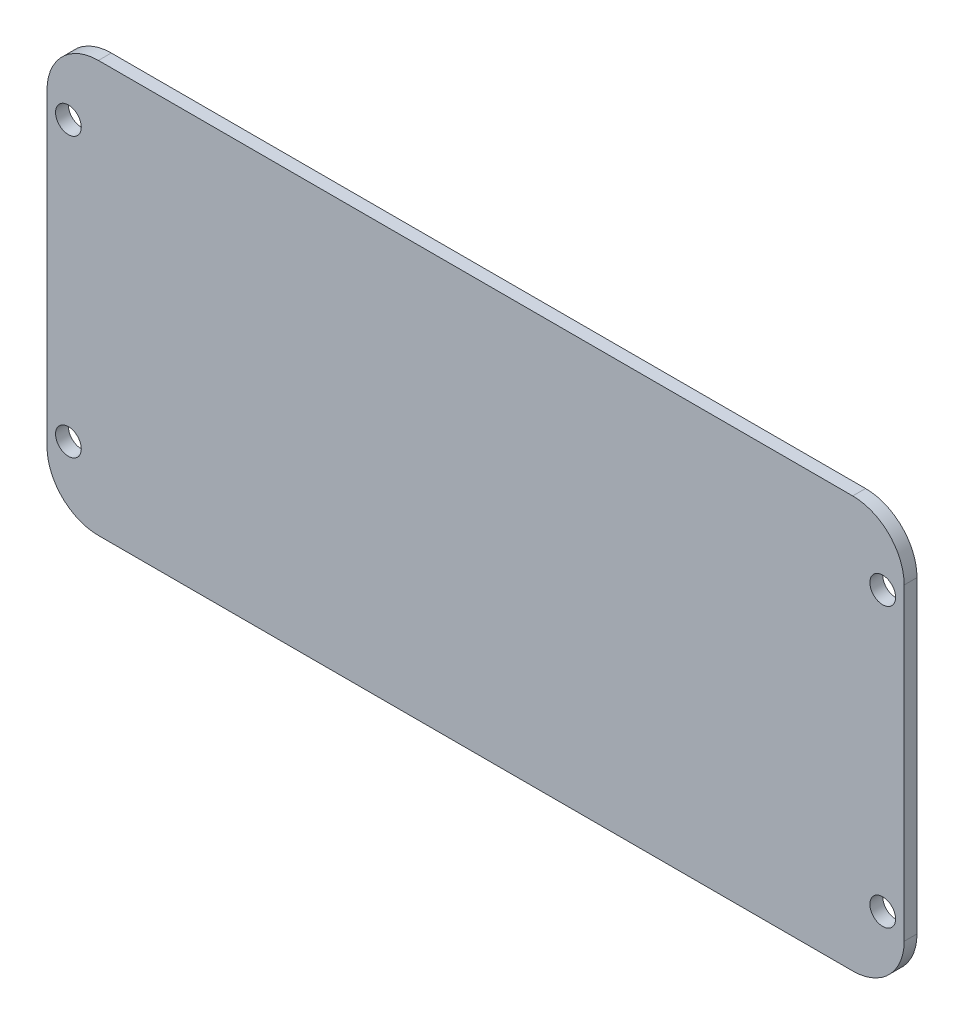
ISO-10303-21;
HEADER;
FILE_DESCRIPTION(('STEP AP214'),'2;1');
FILE_NAME('part.step','',(''),(''),'','','');
FILE_SCHEMA(('AUTOMOTIVE_DESIGN { 1 0 10303 214 1 1 1 1 }'));
ENDSEC;
DATA;
#1=APPLICATION_CONTEXT('core data for automotive mechanical design processes');
#2=APPLICATION_PROTOCOL_DEFINITION('international standard','automotive_design',2000,#1);
#3=PRODUCT_CONTEXT('',#1,'mechanical');
#4=PRODUCT('Part','Part','',(#3));
#5=PRODUCT_RELATED_PRODUCT_CATEGORY('part','',(#4));
#6=PRODUCT_DEFINITION_FORMATION('','',#4);
#7=PRODUCT_DEFINITION_CONTEXT('part definition',#1,'design');
#8=PRODUCT_DEFINITION('design','',#6,#7);
#9=PRODUCT_DEFINITION_SHAPE('','',#8);
#10=(LENGTH_UNIT() NAMED_UNIT(*) SI_UNIT(.MILLI.,.METRE.));
#11=(NAMED_UNIT(*) PLANE_ANGLE_UNIT() SI_UNIT($,.RADIAN.));
#12=(NAMED_UNIT(*) SI_UNIT($,.STERADIAN.) SOLID_ANGLE_UNIT());
#13=UNCERTAINTY_MEASURE_WITH_UNIT(LENGTH_MEASURE(1.E-05),#10,'distance_accuracy_value','');
#14=(GEOMETRIC_REPRESENTATION_CONTEXT(3) GLOBAL_UNCERTAINTY_ASSIGNED_CONTEXT((#13)) GLOBAL_UNIT_ASSIGNED_CONTEXT((#10,
#11,#12)) REPRESENTATION_CONTEXT('',''));
#15=CARTESIAN_POINT('',(0.,0.,0.));
#16=DIRECTION('',(0.,0.,1.));
#17=DIRECTION('',(1.,0.,0.));
#18=AXIS2_PLACEMENT_3D('',#15,#16,#17);
#19=CARTESIAN_POINT('',(49.4107481559537,14.8,1.5));
#20=DIRECTION('',(0.,0.,1.));
#21=DIRECTION('',(1.,0.,0.));
#22=AXIS2_PLACEMENT_3D('',#19,#20,#21);
#23=PLANE('',#22);
#24=CARTESIAN_POINT('',(52.9107481559537,-19.45,1.5));
#25=DIRECTION('',(0.,0.,1.));
#26=DIRECTION('',(1.,0.,0.));
#27=AXIS2_PLACEMENT_3D('',#24,#25,#26);
#28=CIRCLE('',#27,1.5);
#29=CARTESIAN_POINT('',(54.4107481559537,-19.45,1.5));
#30=VERTEX_POINT('',#29);
#31=EDGE_CURVE('E187',#30,#30,#28,.T.);
#32=ORIENTED_EDGE('',*,*,#31,.F.);
#33=EDGE_LOOP('',(#32));
#34=FACE_BOUND('',#33,.T.);
#35=CARTESIAN_POINT('',(-42.0892518440463,13.05,1.5));
#36=DIRECTION('',(0.,0.,1.));
#37=DIRECTION('',(1.,0.,0.));
#38=AXIS2_PLACEMENT_3D('',#35,#36,#37);
#39=CIRCLE('',#38,1.5);
#40=CARTESIAN_POINT('',(-40.5892518440463,13.05,1.5));
#41=VERTEX_POINT('',#40);
#42=EDGE_CURVE('E133',#41,#41,#39,.T.);
#43=ORIENTED_EDGE('',*,*,#42,.F.);
#44=EDGE_LOOP('',(#43));
#45=FACE_BOUND('',#44,.T.);
#46=CARTESIAN_POINT('',(49.4107481559537,14.8,1.5));
#47=DIRECTION('',(0.,0.,1.));
#48=DIRECTION('',(1.,0.,0.));
#49=AXIS2_PLACEMENT_3D('',#46,#47,#48);
#50=CIRCLE('',#49,6.);
#51=CARTESIAN_POINT('',(55.4107481559537,14.8,1.5));
#52=VERTEX_POINT('',#51);
#53=CARTESIAN_POINT('',(49.4107481559536,20.8,1.5));
#54=VERTEX_POINT('',#53);
#55=EDGE_CURVE('E144',#52,#54,#50,.T.);
#56=ORIENTED_EDGE('',*,*,#55,.T.);
#57=DIRECTION('',(-1.,0.,0.));
#58=VECTOR('',#57,1.);
#59=CARTESIAN_POINT('',(-38.5892518440463,20.8,1.5));
#60=LINE('',#59,#58);
#61=CARTESIAN_POINT('',(-38.5892518440463,20.8,1.5));
#62=VERTEX_POINT('',#61);
#63=EDGE_CURVE('E92',#54,#62,#60,.T.);
#64=ORIENTED_EDGE('',*,*,#63,.T.);
#65=CARTESIAN_POINT('',(-38.5892518440463,14.8,1.5));
#66=DIRECTION('',(0.,0.,1.));
#67=DIRECTION('',(-1.,0.,0.));
#68=AXIS2_PLACEMENT_3D('',#65,#66,#67);
#69=CIRCLE('',#68,6.);
#70=CARTESIAN_POINT('',(-44.5892518440463,14.8,1.5));
#71=VERTEX_POINT('',#70);
#72=EDGE_CURVE('E159',#62,#71,#69,.T.);
#73=ORIENTED_EDGE('',*,*,#72,.T.);
#74=DIRECTION('',(0.,-1.,0.));
#75=VECTOR('',#74,1.);
#76=CARTESIAN_POINT('',(-44.5892518440463,-21.2,1.5));
#77=LINE('',#76,#75);
#78=CARTESIAN_POINT('',(-44.5892518440463,-21.2,1.5));
#79=VERTEX_POINT('',#78);
#80=EDGE_CURVE('E172',#71,#79,#77,.T.);
#81=ORIENTED_EDGE('',*,*,#80,.T.);
#82=CARTESIAN_POINT('',(-38.5892518440463,-21.2,1.5));
#83=DIRECTION('',(0.,0.,1.));
#84=DIRECTION('',(-1.,0.,0.));
#85=AXIS2_PLACEMENT_3D('',#82,#83,#84);
#86=CIRCLE('',#85,6.);
#87=CARTESIAN_POINT('',(-38.5892518440463,-27.2,1.5));
#88=VERTEX_POINT('',#87);
#89=EDGE_CURVE('E111',#79,#88,#86,.T.);
#90=ORIENTED_EDGE('',*,*,#89,.T.);
#91=DIRECTION('',(1.,0.,0.));
#92=VECTOR('',#91,1.);
#93=CARTESIAN_POINT('',(49.4107481559536,-27.2,1.5));
#94=LINE('',#93,#92);
#95=CARTESIAN_POINT('',(49.4107481559536,-27.2,1.5));
#96=VERTEX_POINT('',#95);
#97=EDGE_CURVE('E105',#88,#96,#94,.T.);
#98=ORIENTED_EDGE('',*,*,#97,.T.);
#99=CARTESIAN_POINT('',(49.4107481559537,-21.2,1.5));
#100=DIRECTION('',(0.,0.,1.));
#101=DIRECTION('',(-1.,0.,0.));
#102=AXIS2_PLACEMENT_3D('',#99,#100,#101);
#103=CIRCLE('',#102,6.);
#104=CARTESIAN_POINT('',(55.4107481559537,-21.1999999999999,1.5));
#105=VERTEX_POINT('',#104);
#106=EDGE_CURVE('E109',#96,#105,#103,.T.);
#107=ORIENTED_EDGE('',*,*,#106,.T.);
#108=DIRECTION('',(0.,1.,0.));
#109=VECTOR('',#108,1.);
#110=CARTESIAN_POINT('',(55.4107481559537,14.8,1.5));
#111=LINE('',#110,#109);
#112=EDGE_CURVE('E49',#105,#52,#111,.T.);
#113=ORIENTED_EDGE('',*,*,#112,.T.);
#114=EDGE_LOOP('',(#56,#64,#73,#81,#90,#98,#107,#113));
#115=FACE_BOUND('',#114,.T.);
#116=CARTESIAN_POINT('',(-42.0892518440463,-19.45,1.5));
#117=DIRECTION('',(0.,0.,1.));
#118=DIRECTION('',(1.,0.,0.));
#119=AXIS2_PLACEMENT_3D('',#116,#117,#118);
#120=CIRCLE('',#119,1.5);
#121=CARTESIAN_POINT('',(-40.5892518440463,-19.45,1.5));
#122=VERTEX_POINT('',#121);
#123=EDGE_CURVE('E181',#122,#122,#120,.T.);
#124=ORIENTED_EDGE('',*,*,#123,.F.);
#125=EDGE_LOOP('',(#124));
#126=FACE_BOUND('',#125,.T.);
#127=CARTESIAN_POINT('',(52.9107481559537,13.05,1.5));
#128=DIRECTION('',(0.,0.,1.));
#129=DIRECTION('',(1.,0.,0.));
#130=AXIS2_PLACEMENT_3D('',#127,#128,#129);
#131=CIRCLE('',#130,1.5);
#132=CARTESIAN_POINT('',(54.4107481559537,13.05,1.5));
#133=VERTEX_POINT('',#132);
#134=EDGE_CURVE('E193',#133,#133,#131,.T.);
#135=ORIENTED_EDGE('',*,*,#134,.F.);
#136=EDGE_LOOP('',(#135));
#137=FACE_BOUND('',#136,.T.);
#138=ADVANCED_FACE('F32',(#34,#45,#115,#126,#137),#23,.T.);
#139=CARTESIAN_POINT('',(49.4107481559537,14.8,0.));
#140=DIRECTION('',(0.,0.,1.));
#141=DIRECTION('',(1.,0.,0.));
#142=AXIS2_PLACEMENT_3D('',#139,#140,#141);
#143=PLANE('',#142);
#144=CARTESIAN_POINT('',(49.4107481559537,14.8,0.));
#145=DIRECTION('',(0.,0.,1.));
#146=DIRECTION('',(1.,0.,0.));
#147=AXIS2_PLACEMENT_3D('',#144,#145,#146);
#148=CIRCLE('',#147,6.);
#149=CARTESIAN_POINT('',(55.4107481559537,14.8,0.));
#150=VERTEX_POINT('',#149);
#151=CARTESIAN_POINT('',(49.4107481559536,20.8,0.));
#152=VERTEX_POINT('',#151);
#153=EDGE_CURVE('E129',#150,#152,#148,.T.);
#154=ORIENTED_EDGE('',*,*,#153,.F.);
#155=DIRECTION('',(0.,1.,0.));
#156=VECTOR('',#155,1.);
#157=CARTESIAN_POINT('',(55.4107481559537,14.8,0.));
#158=LINE('',#157,#156);
#159=CARTESIAN_POINT('',(55.4107481559537,-21.1999999999999,0.));
#160=VERTEX_POINT('',#159);
#161=EDGE_CURVE('E84',#160,#150,#158,.T.);
#162=ORIENTED_EDGE('',*,*,#161,.F.);
#163=CARTESIAN_POINT('',(49.4107481559537,-21.2,0.));
#164=DIRECTION('',(0.,0.,1.));
#165=DIRECTION('',(-1.,0.,0.));
#166=AXIS2_PLACEMENT_3D('',#163,#164,#165);
#167=CIRCLE('',#166,6.);
#168=CARTESIAN_POINT('',(49.4107481559536,-27.2,0.));
#169=VERTEX_POINT('',#168);
#170=EDGE_CURVE('E78',#169,#160,#167,.T.);
#171=ORIENTED_EDGE('',*,*,#170,.F.);
#172=DIRECTION('',(1.,0.,0.));
#173=VECTOR('',#172,1.);
#174=CARTESIAN_POINT('',(49.4107481559536,-27.2,0.));
#175=LINE('',#174,#173);
#176=CARTESIAN_POINT('',(-38.5892518440463,-27.2,0.));
#177=VERTEX_POINT('',#176);
#178=EDGE_CURVE('E119',#177,#169,#175,.T.);
#179=ORIENTED_EDGE('',*,*,#178,.F.);
#180=CARTESIAN_POINT('',(-38.5892518440463,-21.2,0.));
#181=DIRECTION('',(0.,0.,1.));
#182=DIRECTION('',(-1.,0.,0.));
#183=AXIS2_PLACEMENT_3D('',#180,#181,#182);
#184=CIRCLE('',#183,6.);
#185=CARTESIAN_POINT('',(-44.5892518440463,-21.2,0.));
#186=VERTEX_POINT('',#185);
#187=EDGE_CURVE('E139',#186,#177,#184,.T.);
#188=ORIENTED_EDGE('',*,*,#187,.F.);
#189=DIRECTION('',(0.,-1.,0.));
#190=VECTOR('',#189,1.);
#191=CARTESIAN_POINT('',(-44.5892518440463,-21.2,0.));
#192=LINE('',#191,#190);
#193=CARTESIAN_POINT('',(-44.5892518440463,14.8,0.));
#194=VERTEX_POINT('',#193);
#195=EDGE_CURVE('E137',#194,#186,#192,.T.);
#196=ORIENTED_EDGE('',*,*,#195,.F.);
#197=CARTESIAN_POINT('',(-38.5892518440463,14.8,0.));
#198=DIRECTION('',(0.,0.,1.));
#199=DIRECTION('',(-1.,0.,0.));
#200=AXIS2_PLACEMENT_3D('',#197,#198,#199);
#201=CIRCLE('',#200,6.);
#202=CARTESIAN_POINT('',(-38.5892518440463,20.8,0.));
#203=VERTEX_POINT('',#202);
#204=EDGE_CURVE('E135',#203,#194,#201,.T.);
#205=ORIENTED_EDGE('',*,*,#204,.F.);
#206=DIRECTION('',(-1.,0.,0.));
#207=VECTOR('',#206,1.);
#208=CARTESIAN_POINT('',(-38.5892518440463,20.8,0.));
#209=LINE('',#208,#207);
#210=EDGE_CURVE('E132',#152,#203,#209,.T.);
#211=ORIENTED_EDGE('',*,*,#210,.F.);
#212=EDGE_LOOP('',(#154,#162,#171,#179,#188,#196,#205,#211));
#213=FACE_BOUND('',#212,.T.);
#214=CARTESIAN_POINT('',(-42.0892518440463,13.05,0.));
#215=DIRECTION('',(0.,0.,1.));
#216=DIRECTION('',(1.,0.,0.));
#217=AXIS2_PLACEMENT_3D('',#214,#215,#216);
#218=CIRCLE('',#217,1.5);
#219=CARTESIAN_POINT('',(-40.5892518440463,13.05,0.));
#220=VERTEX_POINT('',#219);
#221=EDGE_CURVE('E178',#220,#220,#218,.T.);
#222=ORIENTED_EDGE('',*,*,#221,.T.);
#223=EDGE_LOOP('',(#222));
#224=FACE_BOUND('',#223,.T.);
#225=CARTESIAN_POINT('',(-42.0892518440463,-19.45,0.));
#226=DIRECTION('',(0.,0.,1.));
#227=DIRECTION('',(1.,0.,0.));
#228=AXIS2_PLACEMENT_3D('',#225,#226,#227);
#229=CIRCLE('',#228,1.5);
#230=CARTESIAN_POINT('',(-40.5892518440463,-19.45,0.));
#231=VERTEX_POINT('',#230);
#232=EDGE_CURVE('E184',#231,#231,#229,.T.);
#233=ORIENTED_EDGE('',*,*,#232,.T.);
#234=EDGE_LOOP('',(#233));
#235=FACE_BOUND('',#234,.T.);
#236=CARTESIAN_POINT('',(52.9107481559537,-19.45,0.));
#237=DIRECTION('',(0.,0.,1.));
#238=DIRECTION('',(1.,0.,0.));
#239=AXIS2_PLACEMENT_3D('',#236,#237,#238);
#240=CIRCLE('',#239,1.5);
#241=CARTESIAN_POINT('',(54.4107481559537,-19.45,0.));
#242=VERTEX_POINT('',#241);
#243=EDGE_CURVE('E190',#242,#242,#240,.T.);
#244=ORIENTED_EDGE('',*,*,#243,.T.);
#245=EDGE_LOOP('',(#244));
#246=FACE_BOUND('',#245,.T.);
#247=CARTESIAN_POINT('',(52.9107481559537,13.05,0.));
#248=DIRECTION('',(0.,0.,1.));
#249=DIRECTION('',(1.,0.,0.));
#250=AXIS2_PLACEMENT_3D('',#247,#248,#249);
#251=CIRCLE('',#250,1.5);
#252=CARTESIAN_POINT('',(54.4107481559537,13.05,0.));
#253=VERTEX_POINT('',#252);
#254=EDGE_CURVE('E196',#253,#253,#251,.T.);
#255=ORIENTED_EDGE('',*,*,#254,.T.);
#256=EDGE_LOOP('',(#255));
#257=FACE_BOUND('',#256,.T.);
#258=ADVANCED_FACE('F163',(#213,#224,#235,#246,#257),#143,.F.);
#259=CARTESIAN_POINT('',(49.4107481559537,14.8,1.5));
#260=DIRECTION('',(0.,0.,-1.));
#261=DIRECTION('',(-1.,0.,0.));
#262=AXIS2_PLACEMENT_3D('',#259,#260,#261);
#263=CYLINDRICAL_SURFACE('',#262,6.);
#264=ORIENTED_EDGE('',*,*,#153,.T.);
#265=DIRECTION('',(0.,0.,-1.));
#266=VECTOR('',#265,1.);
#267=CARTESIAN_POINT('',(49.4107481559536,20.8,1.5));
#268=LINE('',#267,#266);
#269=EDGE_CURVE('E11',#54,#152,#268,.T.);
#270=ORIENTED_EDGE('',*,*,#269,.F.);
#271=ORIENTED_EDGE('',*,*,#55,.F.);
#272=DIRECTION('',(0.,0.,-1.));
#273=VECTOR('',#272,1.);
#274=CARTESIAN_POINT('',(55.4107481559537,14.8,1.5));
#275=LINE('',#274,#273);
#276=EDGE_CURVE('E125',#52,#150,#275,.T.);
#277=ORIENTED_EDGE('',*,*,#276,.T.);
#278=EDGE_LOOP('',(#264,#270,#271,#277));
#279=FACE_BOUND('',#278,.T.);
#280=ADVANCED_FACE('F34',(#279),#263,.T.);
#281=CARTESIAN_POINT('',(-38.5892518440463,20.8,1.5));
#282=DIRECTION('',(0.,-1.,0.));
#283=DIRECTION('',(0.,0.,-1.));
#284=AXIS2_PLACEMENT_3D('',#281,#282,#283);
#285=PLANE('',#284);
#286=ORIENTED_EDGE('',*,*,#210,.T.);
#287=DIRECTION('',(0.,0.,-1.));
#288=VECTOR('',#287,1.);
#289=CARTESIAN_POINT('',(-38.5892518440463,20.8,1.5));
#290=LINE('',#289,#288);
#291=EDGE_CURVE('E41',#62,#203,#290,.T.);
#292=ORIENTED_EDGE('',*,*,#291,.F.);
#293=ORIENTED_EDGE('',*,*,#63,.F.);
#294=ORIENTED_EDGE('',*,*,#269,.T.);
#295=EDGE_LOOP('',(#286,#292,#293,#294));
#296=FACE_BOUND('',#295,.T.);
#297=ADVANCED_FACE('F230',(#296),#285,.F.);
#298=CARTESIAN_POINT('',(-38.5892518440463,14.8,1.5));
#299=DIRECTION('',(0.,0.,-1.));
#300=DIRECTION('',(-1.,0.,0.));
#301=AXIS2_PLACEMENT_3D('',#298,#299,#300);
#302=CYLINDRICAL_SURFACE('',#301,6.);
#303=ORIENTED_EDGE('',*,*,#204,.T.);
#304=DIRECTION('',(0.,0.,-1.));
#305=VECTOR('',#304,1.);
#306=CARTESIAN_POINT('',(-44.5892518440463,14.8,1.5));
#307=LINE('',#306,#305);
#308=EDGE_CURVE('E151',#71,#194,#307,.T.);
#309=ORIENTED_EDGE('',*,*,#308,.F.);
#310=ORIENTED_EDGE('',*,*,#72,.F.);
#311=ORIENTED_EDGE('',*,*,#291,.T.);
#312=EDGE_LOOP('',(#303,#309,#310,#311));
#313=FACE_BOUND('',#312,.T.);
#314=ADVANCED_FACE('F157',(#313),#302,.T.);
#315=CARTESIAN_POINT('',(-44.5892518440463,-21.2,1.5));
#316=DIRECTION('',(1.,0.,0.));
#317=DIRECTION('',(0.,0.,-1.));
#318=AXIS2_PLACEMENT_3D('',#315,#316,#317);
#319=PLANE('',#318);
#320=ORIENTED_EDGE('',*,*,#195,.T.);
#321=DIRECTION('',(0.,0.,-1.));
#322=VECTOR('',#321,1.);
#323=CARTESIAN_POINT('',(-44.5892518440463,-21.2,1.5));
#324=LINE('',#323,#322);
#325=EDGE_CURVE('E148',#79,#186,#324,.T.);
#326=ORIENTED_EDGE('',*,*,#325,.F.);
#327=ORIENTED_EDGE('',*,*,#80,.F.);
#328=ORIENTED_EDGE('',*,*,#308,.T.);
#329=EDGE_LOOP('',(#320,#326,#327,#328));
#330=FACE_BOUND('',#329,.T.);
#331=ADVANCED_FACE('F168',(#330),#319,.F.);
#332=CARTESIAN_POINT('',(-38.5892518440463,-21.2,1.5));
#333=DIRECTION('',(0.,0.,-1.));
#334=DIRECTION('',(-1.,0.,0.));
#335=AXIS2_PLACEMENT_3D('',#332,#333,#334);
#336=CYLINDRICAL_SURFACE('',#335,6.);
#337=ORIENTED_EDGE('',*,*,#187,.T.);
#338=DIRECTION('',(0.,0.,-1.));
#339=VECTOR('',#338,1.);
#340=CARTESIAN_POINT('',(-38.5892518440463,-27.2,1.5));
#341=LINE('',#340,#339);
#342=EDGE_CURVE('E120',#88,#177,#341,.T.);
#343=ORIENTED_EDGE('',*,*,#342,.F.);
#344=ORIENTED_EDGE('',*,*,#89,.F.);
#345=ORIENTED_EDGE('',*,*,#325,.T.);
#346=EDGE_LOOP('',(#337,#343,#344,#345));
#347=FACE_BOUND('',#346,.T.);
#348=ADVANCED_FACE('F171',(#347),#336,.T.);
#349=CARTESIAN_POINT('',(49.4107481559536,-27.2,1.5));
#350=DIRECTION('',(0.,1.,0.));
#351=DIRECTION('',(-1.,0.,0.));
#352=AXIS2_PLACEMENT_3D('',#349,#350,#351);
#353=PLANE('',#352);
#354=ORIENTED_EDGE('',*,*,#178,.T.);
#355=DIRECTION('',(0.,0.,-1.));
#356=VECTOR('',#355,1.);
#357=CARTESIAN_POINT('',(49.4107481559536,-27.2,1.5));
#358=LINE('',#357,#356);
#359=EDGE_CURVE('E116',#96,#169,#358,.T.);
#360=ORIENTED_EDGE('',*,*,#359,.F.);
#361=ORIENTED_EDGE('',*,*,#97,.F.);
#362=ORIENTED_EDGE('',*,*,#342,.T.);
#363=EDGE_LOOP('',(#354,#360,#361,#362));
#364=FACE_BOUND('',#363,.T.);
#365=ADVANCED_FACE('F117',(#364),#353,.F.);
#366=CARTESIAN_POINT('',(49.4107481559537,-21.2,1.5));
#367=DIRECTION('',(0.,0.,-1.));
#368=DIRECTION('',(-1.,0.,0.));
#369=AXIS2_PLACEMENT_3D('',#366,#367,#368);
#370=CYLINDRICAL_SURFACE('',#369,6.);
#371=ORIENTED_EDGE('',*,*,#170,.T.);
#372=DIRECTION('',(0.,0.,-1.));
#373=VECTOR('',#372,1.);
#374=CARTESIAN_POINT('',(55.4107481559537,-21.1999999999999,1.5));
#375=LINE('',#374,#373);
#376=EDGE_CURVE('E121',#105,#160,#375,.T.);
#377=ORIENTED_EDGE('',*,*,#376,.F.);
#378=ORIENTED_EDGE('',*,*,#106,.F.);
#379=ORIENTED_EDGE('',*,*,#359,.T.);
#380=EDGE_LOOP('',(#371,#377,#378,#379));
#381=FACE_BOUND('',#380,.T.);
#382=ADVANCED_FACE('F123',(#381),#370,.T.);
#383=CARTESIAN_POINT('',(55.4107481559537,14.8,1.5));
#384=DIRECTION('',(-1.,0.,0.));
#385=DIRECTION('',(0.,-1.,0.));
#386=AXIS2_PLACEMENT_3D('',#383,#384,#385);
#387=PLANE('',#386);
#388=ORIENTED_EDGE('',*,*,#161,.T.);
#389=ORIENTED_EDGE('',*,*,#276,.F.);
#390=ORIENTED_EDGE('',*,*,#112,.F.);
#391=ORIENTED_EDGE('',*,*,#376,.T.);
#392=EDGE_LOOP('',(#388,#389,#390,#391));
#393=FACE_BOUND('',#392,.T.);
#394=ADVANCED_FACE('F218',(#393),#387,.F.);
#395=CARTESIAN_POINT('',(-42.0892518440463,13.05,1.5));
#396=DIRECTION('',(0.,0.,-1.));
#397=DIRECTION('',(-1.,0.,0.));
#398=AXIS2_PLACEMENT_3D('',#395,#396,#397);
#399=CYLINDRICAL_SURFACE('',#398,1.5);
#400=ORIENTED_EDGE('',*,*,#42,.T.);
#401=EDGE_LOOP('',(#400));
#402=FACE_BOUND('',#401,.T.);
#403=ORIENTED_EDGE('',*,*,#221,.F.);
#404=EDGE_LOOP('',(#403));
#405=FACE_BOUND('',#404,.T.);
#406=ADVANCED_FACE('F215',(#402,#405),#399,.F.);
#407=CARTESIAN_POINT('',(-42.0892518440463,-19.45,1.5));
#408=DIRECTION('',(0.,0.,-1.));
#409=DIRECTION('',(-1.,0.,0.));
#410=AXIS2_PLACEMENT_3D('',#407,#408,#409);
#411=CYLINDRICAL_SURFACE('',#410,1.5);
#412=ORIENTED_EDGE('',*,*,#123,.T.);
#413=EDGE_LOOP('',(#412));
#414=FACE_BOUND('',#413,.T.);
#415=ORIENTED_EDGE('',*,*,#232,.F.);
#416=EDGE_LOOP('',(#415));
#417=FACE_BOUND('',#416,.T.);
#418=ADVANCED_FACE('F294',(#414,#417),#411,.F.);
#419=CARTESIAN_POINT('',(52.9107481559537,-19.45,1.5));
#420=DIRECTION('',(0.,0.,-1.));
#421=DIRECTION('',(-1.,0.,0.));
#422=AXIS2_PLACEMENT_3D('',#419,#420,#421);
#423=CYLINDRICAL_SURFACE('',#422,1.5);
#424=ORIENTED_EDGE('',*,*,#31,.T.);
#425=EDGE_LOOP('',(#424));
#426=FACE_BOUND('',#425,.T.);
#427=ORIENTED_EDGE('',*,*,#243,.F.);
#428=EDGE_LOOP('',(#427));
#429=FACE_BOUND('',#428,.T.);
#430=ADVANCED_FACE('F302',(#426,#429),#423,.F.);
#431=CARTESIAN_POINT('',(52.9107481559537,13.05,1.5));
#432=DIRECTION('',(0.,0.,-1.));
#433=DIRECTION('',(-1.,0.,0.));
#434=AXIS2_PLACEMENT_3D('',#431,#432,#433);
#435=CYLINDRICAL_SURFACE('',#434,1.5);
#436=ORIENTED_EDGE('',*,*,#134,.T.);
#437=EDGE_LOOP('',(#436));
#438=FACE_BOUND('',#437,.T.);
#439=ORIENTED_EDGE('',*,*,#254,.F.);
#440=EDGE_LOOP('',(#439));
#441=FACE_BOUND('',#440,.T.);
#442=ADVANCED_FACE('F202',(#438,#441),#435,.F.);
#443=CLOSED_SHELL('',(#138,#258,#280,#297,#314,#331,#348,#365,#382,#394,#406,#418,#430,#442));
#444=MANIFOLD_SOLID_BREP('B2',#443);
#445=ADVANCED_BREP_SHAPE_REPRESENTATION('',(#18,#444),#14);
#446=SHAPE_DEFINITION_REPRESENTATION(#9,#445);
ENDSEC;
END-ISO-10303-21;
